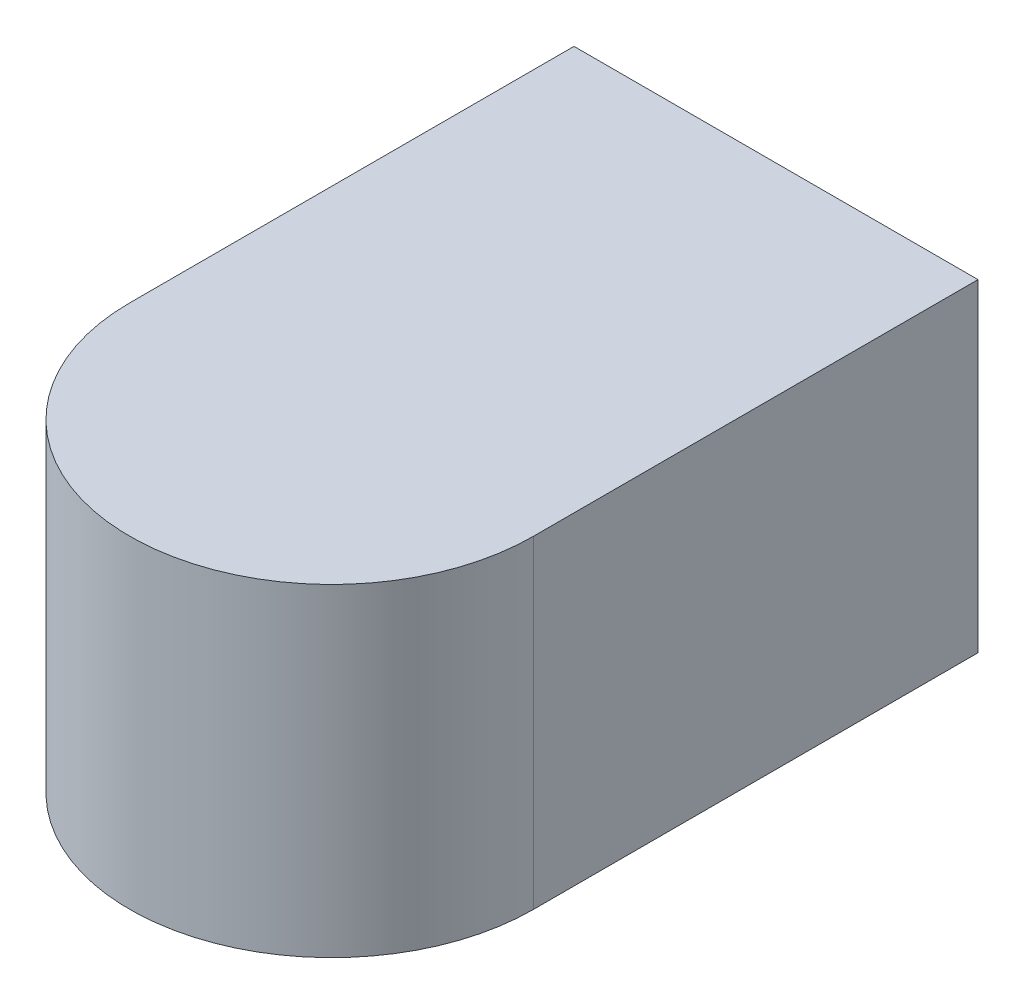
ISO-10303-21;
HEADER;
FILE_DESCRIPTION(('STEP AP214'),'2;1');
FILE_NAME('part.step','',(''),(''),'','','');
FILE_SCHEMA(('AUTOMOTIVE_DESIGN { 1 0 10303 214 1 1 1 1 }'));
ENDSEC;
DATA;
#1=APPLICATION_CONTEXT('core data for automotive mechanical design processes');
#2=APPLICATION_PROTOCOL_DEFINITION('international standard','automotive_design',2000,#1);
#3=PRODUCT_CONTEXT('',#1,'mechanical');
#4=PRODUCT('Part','Part','',(#3));
#5=PRODUCT_RELATED_PRODUCT_CATEGORY('part','',(#4));
#6=PRODUCT_DEFINITION_FORMATION('','',#4);
#7=PRODUCT_DEFINITION_CONTEXT('part definition',#1,'design');
#8=PRODUCT_DEFINITION('design','',#6,#7);
#9=PRODUCT_DEFINITION_SHAPE('','',#8);
#10=(LENGTH_UNIT() NAMED_UNIT(*) SI_UNIT(.MILLI.,.METRE.));
#11=(NAMED_UNIT(*) PLANE_ANGLE_UNIT() SI_UNIT($,.RADIAN.));
#12=(NAMED_UNIT(*) SI_UNIT($,.STERADIAN.) SOLID_ANGLE_UNIT());
#13=UNCERTAINTY_MEASURE_WITH_UNIT(LENGTH_MEASURE(1.E-05),#10,'distance_accuracy_value','');
#14=(GEOMETRIC_REPRESENTATION_CONTEXT(3) GLOBAL_UNCERTAINTY_ASSIGNED_CONTEXT((#13)) GLOBAL_UNIT_ASSIGNED_CONTEXT((#10,
#11,#12)) REPRESENTATION_CONTEXT('',''));
#15=CARTESIAN_POINT('',(0.,0.,0.));
#16=DIRECTION('',(0.,0.,1.));
#17=DIRECTION('',(1.,0.,0.));
#18=AXIS2_PLACEMENT_3D('',#15,#16,#17);
#19=CARTESIAN_POINT('',(0.,0.,0.));
#20=DIRECTION('',(0.,1.,0.));
#21=DIRECTION('',(1.,0.,0.));
#22=AXIS2_PLACEMENT_3D('',#19,#20,#21);
#23=PLANE('',#22);
#24=DIRECTION('',(-1.,0.,0.));
#25=VECTOR('',#24,1.);
#26=CARTESIAN_POINT('',(0.375,0.,-1.5));
#27=LINE('',#26,#25);
#28=CARTESIAN_POINT('',(0.375,0.,-1.5));
#29=VERTEX_POINT('',#28);
#30=CARTESIAN_POINT('',(0.125,0.,-1.5));
#31=VERTEX_POINT('',#30);
#32=EDGE_CURVE('E11',#29,#31,#27,.T.);
#33=ORIENTED_EDGE('',*,*,#32,.F.);
#34=DIRECTION('',(0.,0.,-1.));
#35=VECTOR('',#34,1.);
#36=CARTESIAN_POINT('',(0.375,0.,-1.225));
#37=LINE('',#36,#35);
#38=CARTESIAN_POINT('',(0.375,0.,-1.225));
#39=VERTEX_POINT('',#38);
#40=EDGE_CURVE('E24',#39,#29,#37,.T.);
#41=ORIENTED_EDGE('',*,*,#40,.F.);
#42=CARTESIAN_POINT('',(0.25,0.,-1.225));
#43=DIRECTION('',(0.,1.,0.));
#44=DIRECTION('',(-1.,0.,0.));
#45=AXIS2_PLACEMENT_3D('',#42,#43,#44);
#46=CIRCLE('',#45,0.125);
#47=CARTESIAN_POINT('',(0.125,0.,-1.225));
#48=VERTEX_POINT('',#47);
#49=EDGE_CURVE('E61',#48,#39,#46,.T.);
#50=ORIENTED_EDGE('',*,*,#49,.F.);
#51=DIRECTION('',(0.,0.,1.));
#52=VECTOR('',#51,1.);
#53=CARTESIAN_POINT('',(0.125,0.,-1.5));
#54=LINE('',#53,#52);
#55=EDGE_CURVE('E37',#31,#48,#54,.T.);
#56=ORIENTED_EDGE('',*,*,#55,.F.);
#57=EDGE_LOOP('',(#33,#41,#50,#56));
#58=FACE_BOUND('',#57,.T.);
#59=ADVANCED_FACE('F17',(#58),#23,.F.);
#60=CARTESIAN_POINT('',(0.125,0.,-1.5));
#61=DIRECTION('',(-1.,0.,0.));
#62=DIRECTION('',(0.,0.,1.));
#63=AXIS2_PLACEMENT_3D('',#60,#61,#62);
#64=PLANE('',#63);
#65=DIRECTION('',(0.,1.,0.));
#66=VECTOR('',#65,1.);
#67=CARTESIAN_POINT('',(0.125,0.,-1.225));
#68=LINE('',#67,#66);
#69=CARTESIAN_POINT('',(0.125,0.2,-1.225));
#70=VERTEX_POINT('',#69);
#71=EDGE_CURVE('E84',#48,#70,#68,.T.);
#72=ORIENTED_EDGE('',*,*,#71,.T.);
#73=DIRECTION('',(0.,0.,1.));
#74=VECTOR('',#73,1.);
#75=CARTESIAN_POINT('',(0.125,0.2,-1.5));
#76=LINE('',#75,#74);
#77=CARTESIAN_POINT('',(0.125,0.2,-1.5));
#78=VERTEX_POINT('',#77);
#79=EDGE_CURVE('E74',#78,#70,#76,.T.);
#80=ORIENTED_EDGE('',*,*,#79,.F.);
#81=DIRECTION('',(0.,1.,0.));
#82=VECTOR('',#81,1.);
#83=CARTESIAN_POINT('',(0.125,0.,-1.5));
#84=LINE('',#83,#82);
#85=EDGE_CURVE('E81',#31,#78,#84,.T.);
#86=ORIENTED_EDGE('',*,*,#85,.F.);
#87=ORIENTED_EDGE('',*,*,#55,.T.);
#88=EDGE_LOOP('',(#72,#80,#86,#87));
#89=FACE_BOUND('',#88,.T.);
#90=ADVANCED_FACE('F89',(#89),#64,.T.);
#91=CARTESIAN_POINT('',(0.375,0.,-1.5));
#92=DIRECTION('',(0.,0.,-1.));
#93=DIRECTION('',(-1.,0.,0.));
#94=AXIS2_PLACEMENT_3D('',#91,#92,#93);
#95=PLANE('',#94);
#96=ORIENTED_EDGE('',*,*,#85,.T.);
#97=DIRECTION('',(-1.,0.,0.));
#98=VECTOR('',#97,1.);
#99=CARTESIAN_POINT('',(0.375,0.2,-1.5));
#100=LINE('',#99,#98);
#101=CARTESIAN_POINT('',(0.375,0.2,-1.5));
#102=VERTEX_POINT('',#101);
#103=EDGE_CURVE('E79',#102,#78,#100,.T.);
#104=ORIENTED_EDGE('',*,*,#103,.F.);
#105=DIRECTION('',(0.,1.,0.));
#106=VECTOR('',#105,1.);
#107=CARTESIAN_POINT('',(0.375,0.,-1.5));
#108=LINE('',#107,#106);
#109=EDGE_CURVE('E67',#29,#102,#108,.T.);
#110=ORIENTED_EDGE('',*,*,#109,.F.);
#111=ORIENTED_EDGE('',*,*,#32,.T.);
#112=EDGE_LOOP('',(#96,#104,#110,#111));
#113=FACE_BOUND('',#112,.T.);
#114=ADVANCED_FACE('F91',(#113),#95,.T.);
#115=CARTESIAN_POINT('',(0.375,0.,-1.225));
#116=DIRECTION('',(1.,0.,0.));
#117=DIRECTION('',(0.,0.,-1.));
#118=AXIS2_PLACEMENT_3D('',#115,#116,#117);
#119=PLANE('',#118);
#120=ORIENTED_EDGE('',*,*,#109,.T.);
#121=DIRECTION('',(0.,0.,-1.));
#122=VECTOR('',#121,1.);
#123=CARTESIAN_POINT('',(0.375,0.2,-1.225));
#124=LINE('',#123,#122);
#125=CARTESIAN_POINT('',(0.375,0.2,-1.225));
#126=VERTEX_POINT('',#125);
#127=EDGE_CURVE('E62',#126,#102,#124,.T.);
#128=ORIENTED_EDGE('',*,*,#127,.F.);
#129=DIRECTION('',(0.,1.,0.));
#130=VECTOR('',#129,1.);
#131=CARTESIAN_POINT('',(0.375,0.,-1.225));
#132=LINE('',#131,#130);
#133=EDGE_CURVE('E55',#39,#126,#132,.T.);
#134=ORIENTED_EDGE('',*,*,#133,.F.);
#135=ORIENTED_EDGE('',*,*,#40,.T.);
#136=EDGE_LOOP('',(#120,#128,#134,#135));
#137=FACE_BOUND('',#136,.T.);
#138=ADVANCED_FACE('F65',(#137),#119,.T.);
#139=CARTESIAN_POINT('',(0.25,0.,-1.225));
#140=DIRECTION('',(0.,1.,0.));
#141=DIRECTION('',(1.,0.,0.));
#142=AXIS2_PLACEMENT_3D('',#139,#140,#141);
#143=CYLINDRICAL_SURFACE('',#142,0.125);
#144=ORIENTED_EDGE('',*,*,#133,.T.);
#145=CARTESIAN_POINT('',(0.25,0.2,-1.225));
#146=DIRECTION('',(0.,1.,0.));
#147=DIRECTION('',(-1.,0.,0.));
#148=AXIS2_PLACEMENT_3D('',#145,#146,#147);
#149=CIRCLE('',#148,0.125);
#150=EDGE_CURVE('E60',#70,#126,#149,.T.);
#151=ORIENTED_EDGE('',*,*,#150,.F.);
#152=ORIENTED_EDGE('',*,*,#71,.F.);
#153=ORIENTED_EDGE('',*,*,#49,.T.);
#154=EDGE_LOOP('',(#144,#151,#152,#153));
#155=FACE_BOUND('',#154,.T.);
#156=ADVANCED_FACE('F57',(#155),#143,.T.);
#157=CARTESIAN_POINT('',(0.,0.2,0.));
#158=DIRECTION('',(0.,1.,0.));
#159=DIRECTION('',(1.,0.,0.));
#160=AXIS2_PLACEMENT_3D('',#157,#158,#159);
#161=PLANE('',#160);
#162=ORIENTED_EDGE('',*,*,#150,.T.);
#163=ORIENTED_EDGE('',*,*,#127,.T.);
#164=ORIENTED_EDGE('',*,*,#103,.T.);
#165=ORIENTED_EDGE('',*,*,#79,.T.);
#166=EDGE_LOOP('',(#162,#163,#164,#165));
#167=FACE_BOUND('',#166,.T.);
#168=ADVANCED_FACE('F72',(#167),#161,.T.);
#169=CLOSED_SHELL('',(#59,#90,#114,#138,#156,#168));
#170=MANIFOLD_SOLID_BREP('B1',#169);
#171=ADVANCED_BREP_SHAPE_REPRESENTATION('',(#18,#170),#14);
#172=SHAPE_DEFINITION_REPRESENTATION(#9,#171);
ENDSEC;
END-ISO-10303-21;
